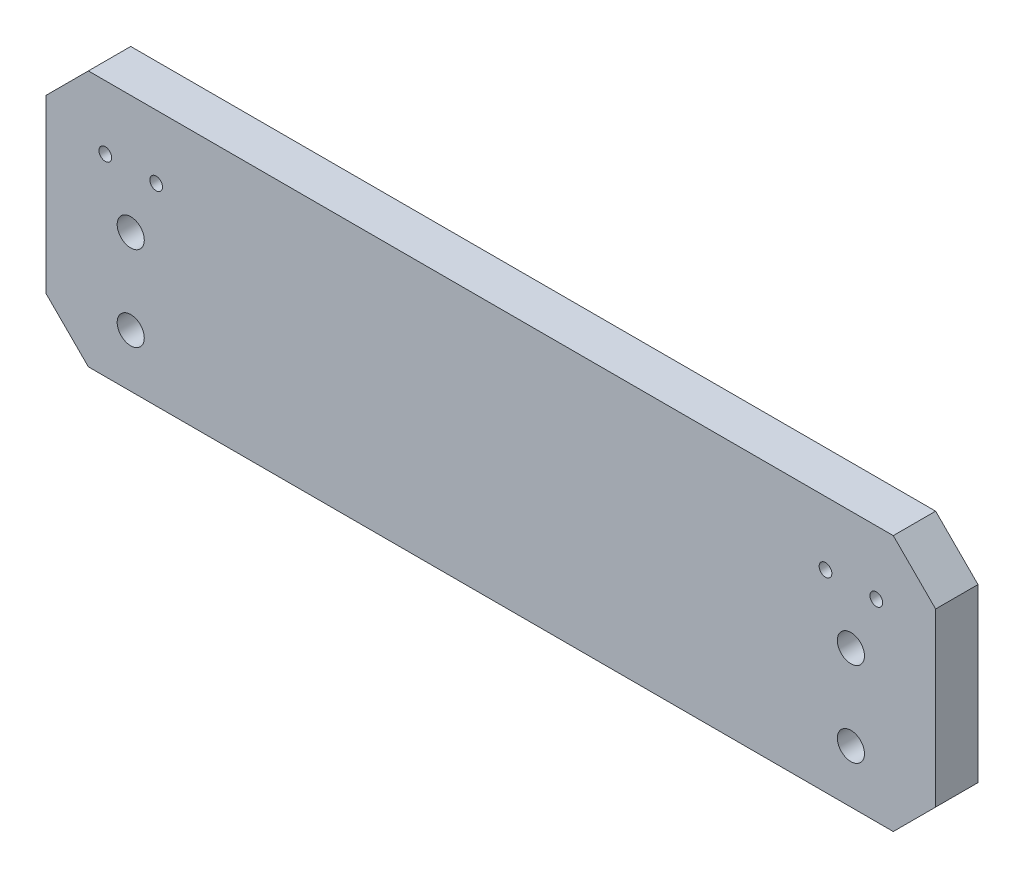
ISO-10303-21;
HEADER;
FILE_DESCRIPTION(('STEP AP214'),'2;1');
FILE_NAME('part.step','',(''),(''),'','','');
FILE_SCHEMA(('AUTOMOTIVE_DESIGN { 1 0 10303 214 1 1 1 1 }'));
ENDSEC;
DATA;
#1=APPLICATION_CONTEXT('core data for automotive mechanical design processes');
#2=APPLICATION_PROTOCOL_DEFINITION('international standard','automotive_design',2000,#1);
#3=PRODUCT_CONTEXT('',#1,'mechanical');
#4=PRODUCT('Part','Part','',(#3));
#5=PRODUCT_RELATED_PRODUCT_CATEGORY('part','',(#4));
#6=PRODUCT_DEFINITION_FORMATION('','',#4);
#7=PRODUCT_DEFINITION_CONTEXT('part definition',#1,'design');
#8=PRODUCT_DEFINITION('design','',#6,#7);
#9=PRODUCT_DEFINITION_SHAPE('','',#8);
#10=(LENGTH_UNIT() NAMED_UNIT(*) SI_UNIT(.MILLI.,.METRE.));
#11=(NAMED_UNIT(*) PLANE_ANGLE_UNIT() SI_UNIT($,.RADIAN.));
#12=(NAMED_UNIT(*) SI_UNIT($,.STERADIAN.) SOLID_ANGLE_UNIT());
#13=UNCERTAINTY_MEASURE_WITH_UNIT(LENGTH_MEASURE(1.E-05),#10,'distance_accuracy_value','');
#14=(GEOMETRIC_REPRESENTATION_CONTEXT(3) GLOBAL_UNCERTAINTY_ASSIGNED_CONTEXT((#13)) GLOBAL_UNIT_ASSIGNED_CONTEXT((#10,
#11,#12)) REPRESENTATION_CONTEXT('',''));
#15=CARTESIAN_POINT('',(0.,0.,0.));
#16=DIRECTION('',(0.,0.,1.));
#17=DIRECTION('',(1.,0.,0.));
#18=AXIS2_PLACEMENT_3D('',#15,#16,#17);
#19=CARTESIAN_POINT('',(0.,0.,10.));
#20=DIRECTION('',(0.,0.,-1.));
#21=DIRECTION('',(-1.,0.,0.));
#22=AXIS2_PLACEMENT_3D('',#19,#20,#21);
#23=PLANE('',#22);
#24=DIRECTION('',(1.,0.,0.));
#25=VECTOR('',#24,1.);
#26=CARTESIAN_POINT('',(-105.,-30.25,10.));
#27=LINE('',#26,#25);
#28=CARTESIAN_POINT('',(-95.,-30.25,10.));
#29=VERTEX_POINT('',#28);
#30=CARTESIAN_POINT('',(95.,-30.25,10.));
#31=VERTEX_POINT('',#30);
#32=EDGE_CURVE('E146',#29,#31,#27,.T.);
#33=ORIENTED_EDGE('',*,*,#32,.T.);
#34=DIRECTION('',(-0.70710678118655,-0.707106781186545,0.));
#35=VECTOR('',#34,1.);
#36=CARTESIAN_POINT('',(105.,-20.25,10.));
#37=LINE('',#36,#35);
#38=CARTESIAN_POINT('',(105.,-20.25,10.));
#39=VERTEX_POINT('',#38);
#40=EDGE_CURVE('E50',#31,#39,#37,.F.);
#41=ORIENTED_EDGE('',*,*,#40,.T.);
#42=DIRECTION('',(0.,1.,0.));
#43=VECTOR('',#42,1.);
#44=CARTESIAN_POINT('',(105.,-30.25,10.));
#45=LINE('',#44,#43);
#46=CARTESIAN_POINT('',(105.,20.25,10.));
#47=VERTEX_POINT('',#46);
#48=EDGE_CURVE('E145',#39,#47,#45,.T.);
#49=ORIENTED_EDGE('',*,*,#48,.T.);
#50=DIRECTION('',(0.707106781186547,-0.707106781186548,0.));
#51=VECTOR('',#50,1.);
#52=CARTESIAN_POINT('',(95.,30.25,10.));
#53=LINE('',#52,#51);
#54=CARTESIAN_POINT('',(95.,30.25,10.));
#55=VERTEX_POINT('',#54);
#56=EDGE_CURVE('E152',#47,#55,#53,.F.);
#57=ORIENTED_EDGE('',*,*,#56,.T.);
#58=DIRECTION('',(-1.,0.,0.));
#59=VECTOR('',#58,1.);
#60=CARTESIAN_POINT('',(-105.,30.25,10.));
#61=LINE('',#60,#59);
#62=CARTESIAN_POINT('',(-95.,30.25,10.));
#63=VERTEX_POINT('',#62);
#64=EDGE_CURVE('E129',#55,#63,#61,.T.);
#65=ORIENTED_EDGE('',*,*,#64,.T.);
#66=DIRECTION('',(0.707106781186549,0.707106781186546,0.));
#67=VECTOR('',#66,1.);
#68=CARTESIAN_POINT('',(-105.,20.25,10.));
#69=LINE('',#68,#67);
#70=CARTESIAN_POINT('',(-105.,20.25,10.));
#71=VERTEX_POINT('',#70);
#72=EDGE_CURVE('E150',#63,#71,#69,.F.);
#73=ORIENTED_EDGE('',*,*,#72,.T.);
#74=DIRECTION('',(0.,-1.,0.));
#75=VECTOR('',#74,1.);
#76=CARTESIAN_POINT('',(-105.,-30.25,10.));
#77=LINE('',#76,#75);
#78=CARTESIAN_POINT('',(-105.,-20.25,10.));
#79=VERTEX_POINT('',#78);
#80=EDGE_CURVE('E186',#71,#79,#77,.T.);
#81=ORIENTED_EDGE('',*,*,#80,.T.);
#82=DIRECTION('',(-0.707106781186546,0.707106781186549,0.));
#83=VECTOR('',#82,1.);
#84=CARTESIAN_POINT('',(-95.,-30.25,10.));
#85=LINE('',#84,#83);
#86=EDGE_CURVE('E168',#79,#29,#85,.F.);
#87=ORIENTED_EDGE('',*,*,#86,.T.);
#88=EDGE_LOOP('',(#33,#41,#49,#57,#65,#73,#81,#87));
#89=FACE_BOUND('',#88,.T.);
#90=CARTESIAN_POINT('',(-85.,2.24999999999997,10.));
#91=DIRECTION('',(0.,0.,1.));
#92=DIRECTION('',(1.,0.,0.));
#93=AXIS2_PLACEMENT_3D('',#90,#91,#92);
#94=CIRCLE('',#93,3.2);
#95=CARTESIAN_POINT('',(-81.8,2.24999999999997,10.));
#96=VERTEX_POINT('',#95);
#97=EDGE_CURVE('E140',#96,#96,#94,.T.);
#98=ORIENTED_EDGE('',*,*,#97,.F.);
#99=EDGE_LOOP('',(#98));
#100=FACE_BOUND('',#99,.T.);
#101=CARTESIAN_POINT('',(-85.,-17.75,10.));
#102=DIRECTION('',(0.,0.,1.));
#103=DIRECTION('',(1.,0.,0.));
#104=AXIS2_PLACEMENT_3D('',#101,#102,#103);
#105=CIRCLE('',#104,3.2);
#106=CARTESIAN_POINT('',(-81.8,-17.75,10.));
#107=VERTEX_POINT('',#106);
#108=EDGE_CURVE('E196',#107,#107,#105,.T.);
#109=ORIENTED_EDGE('',*,*,#108,.F.);
#110=EDGE_LOOP('',(#109));
#111=FACE_BOUND('',#110,.T.);
#112=CARTESIAN_POINT('',(85.,-17.75,10.));
#113=DIRECTION('',(0.,0.,1.));
#114=DIRECTION('',(-1.,0.,0.));
#115=AXIS2_PLACEMENT_3D('',#112,#113,#114);
#116=CIRCLE('',#115,3.2);
#117=CARTESIAN_POINT('',(81.8,-17.75,10.));
#118=VERTEX_POINT('',#117);
#119=EDGE_CURVE('E202',#118,#118,#116,.T.);
#120=ORIENTED_EDGE('',*,*,#119,.F.);
#121=EDGE_LOOP('',(#120));
#122=FACE_BOUND('',#121,.T.);
#123=CARTESIAN_POINT('',(85.,2.25,10.));
#124=DIRECTION('',(0.,0.,1.));
#125=DIRECTION('',(-1.,0.,0.));
#126=AXIS2_PLACEMENT_3D('',#123,#124,#125);
#127=CIRCLE('',#126,3.2);
#128=CARTESIAN_POINT('',(81.8,2.25,10.));
#129=VERTEX_POINT('',#128);
#130=EDGE_CURVE('E208',#129,#129,#127,.T.);
#131=ORIENTED_EDGE('',*,*,#130,.F.);
#132=EDGE_LOOP('',(#131));
#133=FACE_BOUND('',#132,.T.);
#134=CARTESIAN_POINT('',(-91.,15.25,10.));
#135=DIRECTION('',(0.,0.,1.));
#136=DIRECTION('',(1.,0.,0.));
#137=AXIS2_PLACEMENT_3D('',#134,#135,#136);
#138=CIRCLE('',#137,1.5);
#139=CARTESIAN_POINT('',(-89.5,15.25,10.));
#140=VERTEX_POINT('',#139);
#141=EDGE_CURVE('E214',#140,#140,#138,.T.);
#142=ORIENTED_EDGE('',*,*,#141,.F.);
#143=EDGE_LOOP('',(#142));
#144=FACE_BOUND('',#143,.T.);
#145=CARTESIAN_POINT('',(-79.,15.25,10.));
#146=DIRECTION('',(0.,0.,1.));
#147=DIRECTION('',(1.,0.,0.));
#148=AXIS2_PLACEMENT_3D('',#145,#146,#147);
#149=CIRCLE('',#148,1.5);
#150=CARTESIAN_POINT('',(-77.5,15.25,10.));
#151=VERTEX_POINT('',#150);
#152=EDGE_CURVE('E220',#151,#151,#149,.T.);
#153=ORIENTED_EDGE('',*,*,#152,.F.);
#154=EDGE_LOOP('',(#153));
#155=FACE_BOUND('',#154,.T.);
#156=CARTESIAN_POINT('',(79.,15.25,10.));
#157=DIRECTION('',(0.,0.,1.));
#158=DIRECTION('',(-1.,0.,0.));
#159=AXIS2_PLACEMENT_3D('',#156,#157,#158);
#160=CIRCLE('',#159,1.5);
#161=CARTESIAN_POINT('',(77.5,15.25,10.));
#162=VERTEX_POINT('',#161);
#163=EDGE_CURVE('E226',#162,#162,#160,.T.);
#164=ORIENTED_EDGE('',*,*,#163,.F.);
#165=EDGE_LOOP('',(#164));
#166=FACE_BOUND('',#165,.T.);
#167=CARTESIAN_POINT('',(91.,15.25,10.));
#168=DIRECTION('',(0.,0.,1.));
#169=DIRECTION('',(-1.,0.,0.));
#170=AXIS2_PLACEMENT_3D('',#167,#168,#169);
#171=CIRCLE('',#170,1.5);
#172=CARTESIAN_POINT('',(89.5,15.25,10.));
#173=VERTEX_POINT('',#172);
#174=EDGE_CURVE('E232',#173,#173,#171,.T.);
#175=ORIENTED_EDGE('',*,*,#174,.F.);
#176=EDGE_LOOP('',(#175));
#177=FACE_BOUND('',#176,.T.);
#178=ADVANCED_FACE('F41',(#89,#100,#111,#122,#133,#144,#155,#166,#177),#23,.F.);
#179=CARTESIAN_POINT('',(0.,0.,0.));
#180=DIRECTION('',(0.,0.,-1.));
#181=DIRECTION('',(-1.,0.,0.));
#182=AXIS2_PLACEMENT_3D('',#179,#180,#181);
#183=PLANE('',#182);
#184=CARTESIAN_POINT('',(79.,15.25,0.));
#185=DIRECTION('',(0.,0.,1.));
#186=DIRECTION('',(-1.,0.,0.));
#187=AXIS2_PLACEMENT_3D('',#184,#185,#186);
#188=CIRCLE('',#187,1.5);
#189=CARTESIAN_POINT('',(77.5,15.25,0.));
#190=VERTEX_POINT('',#189);
#191=EDGE_CURVE('E229',#190,#190,#188,.T.);
#192=ORIENTED_EDGE('',*,*,#191,.T.);
#193=EDGE_LOOP('',(#192));
#194=FACE_BOUND('',#193,.T.);
#195=CARTESIAN_POINT('',(-91.,15.25,0.));
#196=DIRECTION('',(0.,0.,1.));
#197=DIRECTION('',(1.,0.,0.));
#198=AXIS2_PLACEMENT_3D('',#195,#196,#197);
#199=CIRCLE('',#198,1.5);
#200=CARTESIAN_POINT('',(-89.5,15.25,0.));
#201=VERTEX_POINT('',#200);
#202=EDGE_CURVE('E217',#201,#201,#199,.T.);
#203=ORIENTED_EDGE('',*,*,#202,.T.);
#204=EDGE_LOOP('',(#203));
#205=FACE_BOUND('',#204,.T.);
#206=CARTESIAN_POINT('',(85.,-17.75,0.));
#207=DIRECTION('',(0.,0.,1.));
#208=DIRECTION('',(-1.,0.,0.));
#209=AXIS2_PLACEMENT_3D('',#206,#207,#208);
#210=CIRCLE('',#209,3.2);
#211=CARTESIAN_POINT('',(81.8,-17.75,0.));
#212=VERTEX_POINT('',#211);
#213=EDGE_CURVE('E205',#212,#212,#210,.T.);
#214=ORIENTED_EDGE('',*,*,#213,.T.);
#215=EDGE_LOOP('',(#214));
#216=FACE_BOUND('',#215,.T.);
#217=CARTESIAN_POINT('',(-85.,2.24999999999997,0.));
#218=DIRECTION('',(0.,0.,1.));
#219=DIRECTION('',(1.,0.,0.));
#220=AXIS2_PLACEMENT_3D('',#217,#218,#219);
#221=CIRCLE('',#220,3.2);
#222=CARTESIAN_POINT('',(-81.8,2.24999999999997,0.));
#223=VERTEX_POINT('',#222);
#224=EDGE_CURVE('E193',#223,#223,#221,.T.);
#225=ORIENTED_EDGE('',*,*,#224,.T.);
#226=EDGE_LOOP('',(#225));
#227=FACE_BOUND('',#226,.T.);
#228=DIRECTION('',(0.,1.,0.));
#229=VECTOR('',#228,1.);
#230=CARTESIAN_POINT('',(105.,-30.25,0.));
#231=LINE('',#230,#229);
#232=CARTESIAN_POINT('',(105.,-20.25,0.));
#233=VERTEX_POINT('',#232);
#234=CARTESIAN_POINT('',(105.,20.25,0.));
#235=VERTEX_POINT('',#234);
#236=EDGE_CURVE('E136',#233,#235,#231,.T.);
#237=ORIENTED_EDGE('',*,*,#236,.F.);
#238=DIRECTION('',(0.70710678118655,0.707106781186545,0.));
#239=VECTOR('',#238,1.);
#240=CARTESIAN_POINT('',(62.6249999999997,-62.6250000000001,0.));
#241=LINE('',#240,#239);
#242=CARTESIAN_POINT('',(95.,-30.25,0.));
#243=VERTEX_POINT('',#242);
#244=EDGE_CURVE('E162',#233,#243,#241,.F.);
#245=ORIENTED_EDGE('',*,*,#244,.T.);
#246=DIRECTION('',(1.,0.,0.));
#247=VECTOR('',#246,1.);
#248=CARTESIAN_POINT('',(-105.,-30.25,0.));
#249=LINE('',#248,#247);
#250=CARTESIAN_POINT('',(-95.,-30.25,0.));
#251=VERTEX_POINT('',#250);
#252=EDGE_CURVE('E138',#251,#243,#249,.T.);
#253=ORIENTED_EDGE('',*,*,#252,.F.);
#254=DIRECTION('',(0.707106781186546,-0.707106781186549,0.));
#255=VECTOR('',#254,1.);
#256=CARTESIAN_POINT('',(-62.6250000000003,-62.6249999999999,0.));
#257=LINE('',#256,#255);
#258=CARTESIAN_POINT('',(-105.,-20.25,0.));
#259=VERTEX_POINT('',#258);
#260=EDGE_CURVE('E160',#251,#259,#257,.F.);
#261=ORIENTED_EDGE('',*,*,#260,.T.);
#262=DIRECTION('',(0.,-1.,0.));
#263=VECTOR('',#262,1.);
#264=CARTESIAN_POINT('',(-105.,-30.25,0.));
#265=LINE('',#264,#263);
#266=CARTESIAN_POINT('',(-105.,20.25,0.));
#267=VERTEX_POINT('',#266);
#268=EDGE_CURVE('E135',#267,#259,#265,.T.);
#269=ORIENTED_EDGE('',*,*,#268,.F.);
#270=DIRECTION('',(-0.707106781186549,-0.707106781186546,0.));
#271=VECTOR('',#270,1.);
#272=CARTESIAN_POINT('',(-62.6249999999997,62.6250000000001,0.));
#273=LINE('',#272,#271);
#274=CARTESIAN_POINT('',(-95.,30.25,0.));
#275=VERTEX_POINT('',#274);
#276=EDGE_CURVE('E120',#267,#275,#273,.F.);
#277=ORIENTED_EDGE('',*,*,#276,.T.);
#278=DIRECTION('',(-1.,0.,0.));
#279=VECTOR('',#278,1.);
#280=CARTESIAN_POINT('',(-105.,30.25,0.));
#281=LINE('',#280,#279);
#282=CARTESIAN_POINT('',(95.,30.25,0.));
#283=VERTEX_POINT('',#282);
#284=EDGE_CURVE('E126',#283,#275,#281,.T.);
#285=ORIENTED_EDGE('',*,*,#284,.F.);
#286=DIRECTION('',(-0.707106781186547,0.707106781186548,0.));
#287=VECTOR('',#286,1.);
#288=CARTESIAN_POINT('',(62.625,62.625,0.));
#289=LINE('',#288,#287);
#290=EDGE_CURVE('E110',#283,#235,#289,.F.);
#291=ORIENTED_EDGE('',*,*,#290,.T.);
#292=EDGE_LOOP('',(#237,#245,#253,#261,#269,#277,#285,#291));
#293=FACE_BOUND('',#292,.T.);
#294=CARTESIAN_POINT('',(-85.,-17.75,0.));
#295=DIRECTION('',(0.,0.,1.));
#296=DIRECTION('',(1.,0.,0.));
#297=AXIS2_PLACEMENT_3D('',#294,#295,#296);
#298=CIRCLE('',#297,3.2);
#299=CARTESIAN_POINT('',(-81.8,-17.75,0.));
#300=VERTEX_POINT('',#299);
#301=EDGE_CURVE('E199',#300,#300,#298,.T.);
#302=ORIENTED_EDGE('',*,*,#301,.T.);
#303=EDGE_LOOP('',(#302));
#304=FACE_BOUND('',#303,.T.);
#305=CARTESIAN_POINT('',(85.,2.25,0.));
#306=DIRECTION('',(0.,0.,1.));
#307=DIRECTION('',(-1.,0.,0.));
#308=AXIS2_PLACEMENT_3D('',#305,#306,#307);
#309=CIRCLE('',#308,3.2);
#310=CARTESIAN_POINT('',(81.8,2.25,0.));
#311=VERTEX_POINT('',#310);
#312=EDGE_CURVE('E211',#311,#311,#309,.T.);
#313=ORIENTED_EDGE('',*,*,#312,.T.);
#314=EDGE_LOOP('',(#313));
#315=FACE_BOUND('',#314,.T.);
#316=CARTESIAN_POINT('',(-79.,15.25,0.));
#317=DIRECTION('',(0.,0.,1.));
#318=DIRECTION('',(1.,0.,0.));
#319=AXIS2_PLACEMENT_3D('',#316,#317,#318);
#320=CIRCLE('',#319,1.5);
#321=CARTESIAN_POINT('',(-77.5,15.25,0.));
#322=VERTEX_POINT('',#321);
#323=EDGE_CURVE('E223',#322,#322,#320,.T.);
#324=ORIENTED_EDGE('',*,*,#323,.T.);
#325=EDGE_LOOP('',(#324));
#326=FACE_BOUND('',#325,.T.);
#327=CARTESIAN_POINT('',(91.,15.25,0.));
#328=DIRECTION('',(0.,0.,1.));
#329=DIRECTION('',(-1.,0.,0.));
#330=AXIS2_PLACEMENT_3D('',#327,#328,#329);
#331=CIRCLE('',#330,1.5);
#332=CARTESIAN_POINT('',(89.5,15.25,0.));
#333=VERTEX_POINT('',#332);
#334=EDGE_CURVE('E235',#333,#333,#331,.T.);
#335=ORIENTED_EDGE('',*,*,#334,.T.);
#336=EDGE_LOOP('',(#335));
#337=FACE_BOUND('',#336,.T.);
#338=ADVANCED_FACE('F132',(#194,#205,#216,#227,#293,#304,#315,#326,#337),#183,.T.);
#339=CARTESIAN_POINT('',(105.,-30.25,10.));
#340=DIRECTION('',(-1.,0.,0.));
#341=DIRECTION('',(0.,-1.,0.));
#342=AXIS2_PLACEMENT_3D('',#339,#340,#341);
#343=PLANE('',#342);
#344=ORIENTED_EDGE('',*,*,#48,.F.);
#345=DIRECTION('',(0.,0.,-1.));
#346=VECTOR('',#345,1.);
#347=CARTESIAN_POINT('',(105.,-20.25,10.));
#348=LINE('',#347,#346);
#349=EDGE_CURVE('E157',#39,#233,#348,.T.);
#350=ORIENTED_EDGE('',*,*,#349,.T.);
#351=ORIENTED_EDGE('',*,*,#236,.T.);
#352=DIRECTION('',(0.,0.,1.));
#353=VECTOR('',#352,1.);
#354=CARTESIAN_POINT('',(105.,20.25,10.));
#355=LINE('',#354,#353);
#356=EDGE_CURVE('E116',#235,#47,#355,.T.);
#357=ORIENTED_EDGE('',*,*,#356,.T.);
#358=EDGE_LOOP('',(#344,#350,#351,#357));
#359=FACE_BOUND('',#358,.T.);
#360=ADVANCED_FACE('F176',(#359),#343,.F.);
#361=CARTESIAN_POINT('',(-105.,30.25,10.));
#362=DIRECTION('',(0.,-1.,0.));
#363=DIRECTION('',(1.,0.,0.));
#364=AXIS2_PLACEMENT_3D('',#361,#362,#363);
#365=PLANE('',#364);
#366=ORIENTED_EDGE('',*,*,#64,.F.);
#367=DIRECTION('',(0.,0.,-1.));
#368=VECTOR('',#367,1.);
#369=CARTESIAN_POINT('',(95.,30.25,10.));
#370=LINE('',#369,#368);
#371=EDGE_CURVE('E114',#55,#283,#370,.T.);
#372=ORIENTED_EDGE('',*,*,#371,.T.);
#373=ORIENTED_EDGE('',*,*,#284,.T.);
#374=DIRECTION('',(0.,0.,1.));
#375=VECTOR('',#374,1.);
#376=CARTESIAN_POINT('',(-95.,30.25,10.));
#377=LINE('',#376,#375);
#378=EDGE_CURVE('E130',#275,#63,#377,.T.);
#379=ORIENTED_EDGE('',*,*,#378,.T.);
#380=EDGE_LOOP('',(#366,#372,#373,#379));
#381=FACE_BOUND('',#380,.T.);
#382=ADVANCED_FACE('F125',(#381),#365,.F.);
#383=CARTESIAN_POINT('',(-105.,-30.25,10.));
#384=DIRECTION('',(1.,0.,0.));
#385=DIRECTION('',(0.,0.,-1.));
#386=AXIS2_PLACEMENT_3D('',#383,#384,#385);
#387=PLANE('',#386);
#388=ORIENTED_EDGE('',*,*,#268,.T.);
#389=DIRECTION('',(0.,0.,1.));
#390=VECTOR('',#389,1.);
#391=CARTESIAN_POINT('',(-105.,-20.25,10.));
#392=LINE('',#391,#390);
#393=EDGE_CURVE('E11',#259,#79,#392,.T.);
#394=ORIENTED_EDGE('',*,*,#393,.T.);
#395=ORIENTED_EDGE('',*,*,#80,.F.);
#396=DIRECTION('',(0.,0.,-1.));
#397=VECTOR('',#396,1.);
#398=CARTESIAN_POINT('',(-105.,20.25,10.));
#399=LINE('',#398,#397);
#400=EDGE_CURVE('E154',#71,#267,#399,.T.);
#401=ORIENTED_EDGE('',*,*,#400,.T.);
#402=EDGE_LOOP('',(#388,#394,#395,#401));
#403=FACE_BOUND('',#402,.T.);
#404=ADVANCED_FACE('F184',(#403),#387,.F.);
#405=CARTESIAN_POINT('',(-105.,-30.25,10.));
#406=DIRECTION('',(0.,1.,0.));
#407=DIRECTION('',(-1.,0.,0.));
#408=AXIS2_PLACEMENT_3D('',#405,#406,#407);
#409=PLANE('',#408);
#410=ORIENTED_EDGE('',*,*,#252,.T.);
#411=DIRECTION('',(0.,0.,1.));
#412=VECTOR('',#411,1.);
#413=CARTESIAN_POINT('',(95.,-30.25,10.));
#414=LINE('',#413,#412);
#415=EDGE_CURVE('E63',#243,#31,#414,.T.);
#416=ORIENTED_EDGE('',*,*,#415,.T.);
#417=ORIENTED_EDGE('',*,*,#32,.F.);
#418=DIRECTION('',(0.,0.,-1.));
#419=VECTOR('',#418,1.);
#420=CARTESIAN_POINT('',(-95.,-30.25,10.));
#421=LINE('',#420,#419);
#422=EDGE_CURVE('E164',#29,#251,#421,.T.);
#423=ORIENTED_EDGE('',*,*,#422,.T.);
#424=EDGE_LOOP('',(#410,#416,#417,#423));
#425=FACE_BOUND('',#424,.T.);
#426=ADVANCED_FACE('F180',(#425),#409,.F.);
#427=CARTESIAN_POINT('',(-85.,2.24999999999997,10.));
#428=DIRECTION('',(0.,0.,-1.));
#429=DIRECTION('',(-1.,0.,0.));
#430=AXIS2_PLACEMENT_3D('',#427,#428,#429);
#431=CYLINDRICAL_SURFACE('',#430,3.2);
#432=ORIENTED_EDGE('',*,*,#97,.T.);
#433=EDGE_LOOP('',(#432));
#434=FACE_BOUND('',#433,.T.);
#435=ORIENTED_EDGE('',*,*,#224,.F.);
#436=EDGE_LOOP('',(#435));
#437=FACE_BOUND('',#436,.T.);
#438=ADVANCED_FACE('F253',(#434,#437),#431,.F.);
#439=CARTESIAN_POINT('',(-85.,-17.75,10.));
#440=DIRECTION('',(0.,0.,-1.));
#441=DIRECTION('',(-1.,0.,0.));
#442=AXIS2_PLACEMENT_3D('',#439,#440,#441);
#443=CYLINDRICAL_SURFACE('',#442,3.2);
#444=ORIENTED_EDGE('',*,*,#108,.T.);
#445=EDGE_LOOP('',(#444));
#446=FACE_BOUND('',#445,.T.);
#447=ORIENTED_EDGE('',*,*,#301,.F.);
#448=EDGE_LOOP('',(#447));
#449=FACE_BOUND('',#448,.T.);
#450=ADVANCED_FACE('F356',(#446,#449),#443,.F.);
#451=CARTESIAN_POINT('',(85.,-17.75,10.));
#452=DIRECTION('',(0.,0.,-1.));
#453=DIRECTION('',(-1.,0.,0.));
#454=AXIS2_PLACEMENT_3D('',#451,#452,#453);
#455=CYLINDRICAL_SURFACE('',#454,3.2);
#456=ORIENTED_EDGE('',*,*,#119,.T.);
#457=EDGE_LOOP('',(#456));
#458=FACE_BOUND('',#457,.T.);
#459=ORIENTED_EDGE('',*,*,#213,.F.);
#460=EDGE_LOOP('',(#459));
#461=FACE_BOUND('',#460,.T.);
#462=ADVANCED_FACE('F346',(#458,#461),#455,.F.);
#463=CARTESIAN_POINT('',(85.,2.25,10.));
#464=DIRECTION('',(0.,0.,-1.));
#465=DIRECTION('',(-1.,0.,0.));
#466=AXIS2_PLACEMENT_3D('',#463,#464,#465);
#467=CYLINDRICAL_SURFACE('',#466,3.2);
#468=ORIENTED_EDGE('',*,*,#130,.T.);
#469=EDGE_LOOP('',(#468));
#470=FACE_BOUND('',#469,.T.);
#471=ORIENTED_EDGE('',*,*,#312,.F.);
#472=EDGE_LOOP('',(#471));
#473=FACE_BOUND('',#472,.T.);
#474=ADVANCED_FACE('F336',(#470,#473),#467,.F.);
#475=CARTESIAN_POINT('',(-91.,15.25,10.));
#476=DIRECTION('',(0.,0.,-1.));
#477=DIRECTION('',(-1.,0.,0.));
#478=AXIS2_PLACEMENT_3D('',#475,#476,#477);
#479=CYLINDRICAL_SURFACE('',#478,1.5);
#480=ORIENTED_EDGE('',*,*,#141,.T.);
#481=EDGE_LOOP('',(#480));
#482=FACE_BOUND('',#481,.T.);
#483=ORIENTED_EDGE('',*,*,#202,.F.);
#484=EDGE_LOOP('',(#483));
#485=FACE_BOUND('',#484,.T.);
#486=ADVANCED_FACE('F326',(#482,#485),#479,.F.);
#487=CARTESIAN_POINT('',(-79.,15.25,10.));
#488=DIRECTION('',(0.,0.,-1.));
#489=DIRECTION('',(-1.,0.,0.));
#490=AXIS2_PLACEMENT_3D('',#487,#488,#489);
#491=CYLINDRICAL_SURFACE('',#490,1.5);
#492=ORIENTED_EDGE('',*,*,#152,.T.);
#493=EDGE_LOOP('',(#492));
#494=FACE_BOUND('',#493,.T.);
#495=ORIENTED_EDGE('',*,*,#323,.F.);
#496=EDGE_LOOP('',(#495));
#497=FACE_BOUND('',#496,.T.);
#498=ADVANCED_FACE('F316',(#494,#497),#491,.F.);
#499=CARTESIAN_POINT('',(79.,15.25,10.));
#500=DIRECTION('',(0.,0.,-1.));
#501=DIRECTION('',(-1.,0.,0.));
#502=AXIS2_PLACEMENT_3D('',#499,#500,#501);
#503=CYLINDRICAL_SURFACE('',#502,1.5);
#504=ORIENTED_EDGE('',*,*,#163,.T.);
#505=EDGE_LOOP('',(#504));
#506=FACE_BOUND('',#505,.T.);
#507=ORIENTED_EDGE('',*,*,#191,.F.);
#508=EDGE_LOOP('',(#507));
#509=FACE_BOUND('',#508,.T.);
#510=ADVANCED_FACE('F307',(#506,#509),#503,.F.);
#511=CARTESIAN_POINT('',(91.,15.25,10.));
#512=DIRECTION('',(0.,0.,-1.));
#513=DIRECTION('',(-1.,0.,0.));
#514=AXIS2_PLACEMENT_3D('',#511,#512,#513);
#515=CYLINDRICAL_SURFACE('',#514,1.5);
#516=ORIENTED_EDGE('',*,*,#174,.T.);
#517=EDGE_LOOP('',(#516));
#518=FACE_BOUND('',#517,.T.);
#519=ORIENTED_EDGE('',*,*,#334,.F.);
#520=EDGE_LOOP('',(#519));
#521=FACE_BOUND('',#520,.T.);
#522=ADVANCED_FACE('F241',(#518,#521),#515,.F.);
#523=CARTESIAN_POINT('',(95.,30.25,10.));
#524=DIRECTION('',(-0.707106781186548,-0.707106781186547,0.));
#525=DIRECTION('',(0.,0.,-1.));
#526=AXIS2_PLACEMENT_3D('',#523,#524,#525);
#527=PLANE('',#526);
#528=ORIENTED_EDGE('',*,*,#56,.F.);
#529=ORIENTED_EDGE('',*,*,#356,.F.);
#530=ORIENTED_EDGE('',*,*,#290,.F.);
#531=ORIENTED_EDGE('',*,*,#371,.F.);
#532=EDGE_LOOP('',(#528,#529,#530,#531));
#533=FACE_BOUND('',#532,.T.);
#534=ADVANCED_FACE('F113',(#533),#527,.F.);
#535=CARTESIAN_POINT('',(-105.,20.25,10.));
#536=DIRECTION('',(0.707106781186546,-0.707106781186549,0.));
#537=DIRECTION('',(0.,0.,-1.));
#538=AXIS2_PLACEMENT_3D('',#535,#536,#537);
#539=PLANE('',#538);
#540=ORIENTED_EDGE('',*,*,#72,.F.);
#541=ORIENTED_EDGE('',*,*,#378,.F.);
#542=ORIENTED_EDGE('',*,*,#276,.F.);
#543=ORIENTED_EDGE('',*,*,#400,.F.);
#544=EDGE_LOOP('',(#540,#541,#542,#543));
#545=FACE_BOUND('',#544,.T.);
#546=ADVANCED_FACE('F189',(#545),#539,.F.);
#547=CARTESIAN_POINT('',(105.,-20.25,10.));
#548=DIRECTION('',(-0.707106781186545,0.70710678118655,0.));
#549=DIRECTION('',(0.,0.,-1.));
#550=AXIS2_PLACEMENT_3D('',#547,#548,#549);
#551=PLANE('',#550);
#552=ORIENTED_EDGE('',*,*,#40,.F.);
#553=ORIENTED_EDGE('',*,*,#415,.F.);
#554=ORIENTED_EDGE('',*,*,#244,.F.);
#555=ORIENTED_EDGE('',*,*,#349,.F.);
#556=EDGE_LOOP('',(#552,#553,#554,#555));
#557=FACE_BOUND('',#556,.T.);
#558=ADVANCED_FACE('F178',(#557),#551,.F.);
#559=CARTESIAN_POINT('',(-95.,-30.25,10.));
#560=DIRECTION('',(0.707106781186549,0.707106781186546,0.));
#561=DIRECTION('',(0.,0.,-1.));
#562=AXIS2_PLACEMENT_3D('',#559,#560,#561);
#563=PLANE('',#562);
#564=ORIENTED_EDGE('',*,*,#86,.F.);
#565=ORIENTED_EDGE('',*,*,#393,.F.);
#566=ORIENTED_EDGE('',*,*,#260,.F.);
#567=ORIENTED_EDGE('',*,*,#422,.F.);
#568=EDGE_LOOP('',(#564,#565,#566,#567));
#569=FACE_BOUND('',#568,.T.);
#570=ADVANCED_FACE('F44',(#569),#563,.F.);
#571=CLOSED_SHELL('',(#178,#338,#360,#382,#404,#426,#438,#450,#462,#474,#486,#498,#510,#522,
#534,#546,#558,#570));
#572=MANIFOLD_SOLID_BREP('B2',#571);
#573=ADVANCED_BREP_SHAPE_REPRESENTATION('',(#18,#572),#14);
#574=SHAPE_DEFINITION_REPRESENTATION(#9,#573);
ENDSEC;
END-ISO-10303-21;
